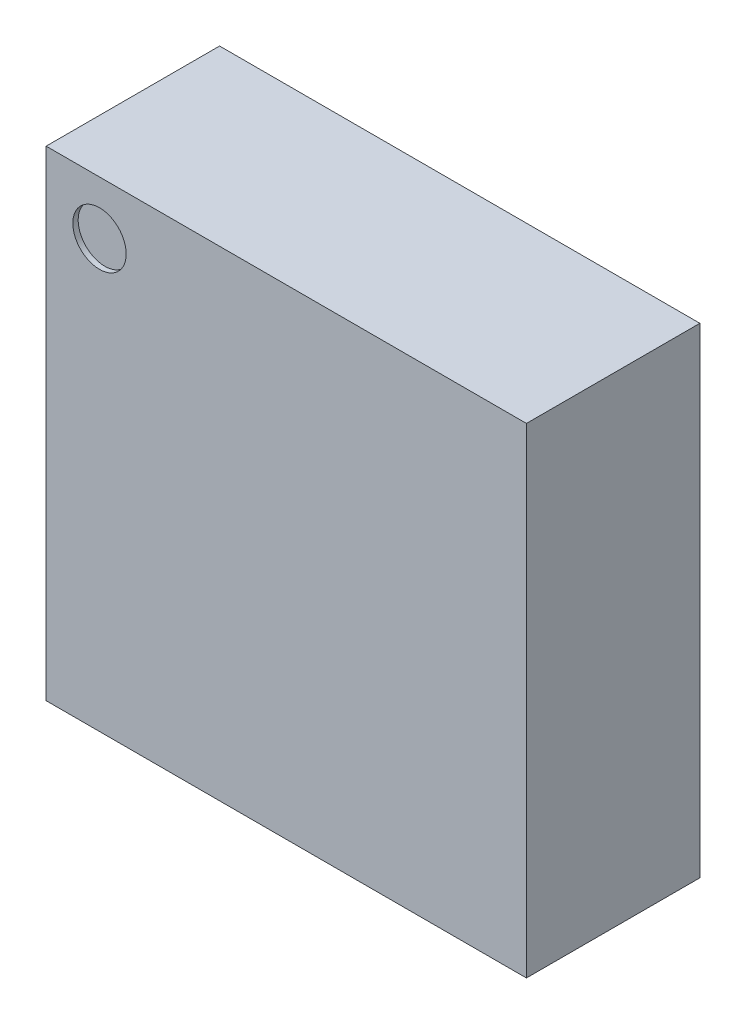
ISO-10303-21;
HEADER;
FILE_DESCRIPTION(('STEP AP214'),'2;1');
FILE_NAME('part.step','',(''),(''),'','','');
FILE_SCHEMA(('AUTOMOTIVE_DESIGN { 1 0 10303 214 1 1 1 1 }'));
ENDSEC;
DATA;
#1=APPLICATION_CONTEXT('core data for automotive mechanical design processes');
#2=APPLICATION_PROTOCOL_DEFINITION('international standard','automotive_design',2000,#1);
#3=PRODUCT_CONTEXT('',#1,'mechanical');
#4=PRODUCT('Part','Part','',(#3));
#5=PRODUCT_RELATED_PRODUCT_CATEGORY('part','',(#4));
#6=PRODUCT_DEFINITION_FORMATION('','',#4);
#7=PRODUCT_DEFINITION_CONTEXT('part definition',#1,'design');
#8=PRODUCT_DEFINITION('design','',#6,#7);
#9=PRODUCT_DEFINITION_SHAPE('','',#8);
#10=(LENGTH_UNIT() NAMED_UNIT(*) SI_UNIT(.MILLI.,.METRE.));
#11=(NAMED_UNIT(*) PLANE_ANGLE_UNIT() SI_UNIT($,.RADIAN.));
#12=(NAMED_UNIT(*) SI_UNIT($,.STERADIAN.) SOLID_ANGLE_UNIT());
#13=UNCERTAINTY_MEASURE_WITH_UNIT(LENGTH_MEASURE(1.E-05),#10,'distance_accuracy_value','');
#14=(GEOMETRIC_REPRESENTATION_CONTEXT(3) GLOBAL_UNCERTAINTY_ASSIGNED_CONTEXT((#13)) GLOBAL_UNIT_ASSIGNED_CONTEXT((#10,
#11,#12)) REPRESENTATION_CONTEXT('',''));
#15=CARTESIAN_POINT('',(0.,0.,0.));
#16=DIRECTION('',(0.,0.,1.));
#17=DIRECTION('',(1.,0.,0.));
#18=AXIS2_PLACEMENT_3D('',#15,#16,#17);
#19=CARTESIAN_POINT('',(0.,-0.4499999999995,0.44625));
#20=DIRECTION('',(0.,0.,1.));
#21=DIRECTION('',(1.,0.,0.));
#22=AXIS2_PLACEMENT_3D('',#19,#20,#21);
#23=PLANE('',#22);
#24=CARTESIAN_POINT('',(-0.35,0.3499999999995,0.44625));
#25=DIRECTION('',(0.,0.,1.));
#26=DIRECTION('',(-1.,0.,0.));
#27=AXIS2_PLACEMENT_3D('',#24,#25,#26);
#28=CIRCLE('',#27,0.05);
#29=CARTESIAN_POINT('',(-0.4,0.3499999999995,0.44625));
#30=VERTEX_POINT('',#29);
#31=CARTESIAN_POINT('',(-0.3,0.3499999999995,0.44625));
#32=VERTEX_POINT('',#31);
#33=EDGE_CURVE('E93',#30,#32,#28,.T.);
#34=ORIENTED_EDGE('',*,*,#33,.T.);
#35=CARTESIAN_POINT('',(-0.35,0.3499999999995,0.44625));
#36=DIRECTION('',(0.,0.,1.));
#37=DIRECTION('',(-1.,0.,0.));
#38=AXIS2_PLACEMENT_3D('',#35,#36,#37);
#39=CIRCLE('',#38,0.05);
#40=EDGE_CURVE('E20',#32,#30,#39,.T.);
#41=ORIENTED_EDGE('',*,*,#40,.T.);
#42=EDGE_LOOP('',(#34,#41));
#43=FACE_BOUND('',#42,.T.);
#44=ADVANCED_FACE('F16',(#43),#23,.T.);
#45=CARTESIAN_POINT('',(-0.35,0.3499999999995,0.45625));
#46=DIRECTION('',(0.,0.,1.));
#47=DIRECTION('',(-1.,0.,0.));
#48=AXIS2_PLACEMENT_3D('',#45,#46,#47);
#49=CYLINDRICAL_SURFACE('',#48,0.05);
#50=ORIENTED_EDGE('',*,*,#33,.F.);
#51=ORIENTED_EDGE('',*,*,#40,.F.);
#52=DIRECTION('',(0.,0.,1.));
#53=VECTOR('',#52,1.);
#54=CARTESIAN_POINT('',(-0.3,0.3499999999995,0.45625));
#55=LINE('',#54,#53);
#56=CARTESIAN_POINT('',(-0.3,0.3499999999995,0.45625));
#57=VERTEX_POINT('',#56);
#58=EDGE_CURVE('E11',#32,#57,#55,.T.);
#59=ORIENTED_EDGE('',*,*,#58,.T.);
#60=CARTESIAN_POINT('',(-0.35,0.3499999999995,0.45625));
#61=DIRECTION('',(0.,0.,1.));
#62=DIRECTION('',(-1.,0.,0.));
#63=AXIS2_PLACEMENT_3D('',#60,#61,#62);
#64=CIRCLE('',#63,0.05);
#65=CARTESIAN_POINT('',(-0.4,0.3499999999995,0.45625));
#66=VERTEX_POINT('',#65);
#67=EDGE_CURVE('E63',#57,#66,#64,.T.);
#68=ORIENTED_EDGE('',*,*,#67,.T.);
#69=CARTESIAN_POINT('',(-0.35,0.3499999999995,0.45625));
#70=DIRECTION('',(0.,0.,1.));
#71=DIRECTION('',(-1.,0.,0.));
#72=AXIS2_PLACEMENT_3D('',#69,#70,#71);
#73=CIRCLE('',#72,0.05);
#74=EDGE_CURVE('E113',#66,#57,#73,.T.);
#75=ORIENTED_EDGE('',*,*,#74,.T.);
#76=ORIENTED_EDGE('',*,*,#58,.F.);
#77=EDGE_LOOP('',(#50,#51,#59,#68,#75,#76));
#78=FACE_BOUND('',#77,.T.);
#79=ADVANCED_FACE('F129',(#78),#49,.F.);
#80=CARTESIAN_POINT('',(0.,0.4499999999995,0.));
#81=DIRECTION('',(0.,1.,0.));
#82=DIRECTION('',(1.,0.,0.));
#83=AXIS2_PLACEMENT_3D('',#80,#81,#82);
#84=PLANE('',#83);
#85=DIRECTION('',(0.,0.,-1.));
#86=VECTOR('',#85,1.);
#87=CARTESIAN_POINT('',(0.45,0.4499999999995,0.45625));
#88=LINE('',#87,#86);
#89=CARTESIAN_POINT('',(0.45,0.4499999999995,0.45625));
#90=VERTEX_POINT('',#89);
#91=CARTESIAN_POINT('',(0.45,0.4499999999995,0.13125));
#92=VERTEX_POINT('',#91);
#93=EDGE_CURVE('E89',#90,#92,#88,.T.);
#94=ORIENTED_EDGE('',*,*,#93,.T.);
#95=DIRECTION('',(-1.,0.,0.));
#96=VECTOR('',#95,1.);
#97=CARTESIAN_POINT('',(0.45,0.4499999999995,0.13125));
#98=LINE('',#97,#96);
#99=CARTESIAN_POINT('',(-0.45,0.4499999999995,0.13125));
#100=VERTEX_POINT('',#99);
#101=EDGE_CURVE('E85',#92,#100,#98,.T.);
#102=ORIENTED_EDGE('',*,*,#101,.T.);
#103=DIRECTION('',(0.,0.,1.));
#104=VECTOR('',#103,1.);
#105=CARTESIAN_POINT('',(-0.45,0.4499999999995,0.13125));
#106=LINE('',#105,#104);
#107=CARTESIAN_POINT('',(-0.45,0.4499999999995,0.45625));
#108=VERTEX_POINT('',#107);
#109=EDGE_CURVE('E76',#100,#108,#106,.T.);
#110=ORIENTED_EDGE('',*,*,#109,.T.);
#111=DIRECTION('',(1.,0.,0.));
#112=VECTOR('',#111,1.);
#113=CARTESIAN_POINT('',(-0.45,0.4499999999995,0.45625));
#114=LINE('',#113,#112);
#115=EDGE_CURVE('E116',#108,#90,#114,.T.);
#116=ORIENTED_EDGE('',*,*,#115,.T.);
#117=EDGE_LOOP('',(#94,#102,#110,#116));
#118=FACE_BOUND('',#117,.T.);
#119=ADVANCED_FACE('F87',(#118),#84,.T.);
#120=CARTESIAN_POINT('',(0.45,-0.4499999999995,0.13125));
#121=DIRECTION('',(0.,0.,-1.));
#122=DIRECTION('',(0.,-1.,0.));
#123=AXIS2_PLACEMENT_3D('',#120,#121,#122);
#124=PLANE('',#123);
#125=DIRECTION('',(-1.,0.,0.));
#126=VECTOR('',#125,1.);
#127=CARTESIAN_POINT('',(0.45,-0.4499999999995,0.13125));
#128=LINE('',#127,#126);
#129=CARTESIAN_POINT('',(0.45,-0.4499999999995,0.13125));
#130=VERTEX_POINT('',#129);
#131=CARTESIAN_POINT('',(-0.45,-0.4499999999995,0.13125));
#132=VERTEX_POINT('',#131);
#133=EDGE_CURVE('E99',#130,#132,#128,.T.);
#134=ORIENTED_EDGE('',*,*,#133,.T.);
#135=DIRECTION('',(0.,1.,0.));
#136=VECTOR('',#135,1.);
#137=CARTESIAN_POINT('',(-0.45,-0.4499999999995,0.13125));
#138=LINE('',#137,#136);
#139=EDGE_CURVE('E94',#132,#100,#138,.T.);
#140=ORIENTED_EDGE('',*,*,#139,.T.);
#141=ORIENTED_EDGE('',*,*,#101,.F.);
#142=DIRECTION('',(0.,1.,0.));
#143=VECTOR('',#142,1.);
#144=CARTESIAN_POINT('',(0.45,-0.4499999999995,0.13125));
#145=LINE('',#144,#143);
#146=EDGE_CURVE('E166',#130,#92,#145,.T.);
#147=ORIENTED_EDGE('',*,*,#146,.F.);
#148=EDGE_LOOP('',(#134,#140,#141,#147));
#149=FACE_BOUND('',#148,.T.);
#150=ADVANCED_FACE('F18',(#149),#124,.T.);
#151=CARTESIAN_POINT('',(-0.45,-0.4499999999995,0.13125));
#152=DIRECTION('',(-1.,0.,0.));
#153=DIRECTION('',(0.,0.,1.));
#154=AXIS2_PLACEMENT_3D('',#151,#152,#153);
#155=PLANE('',#154);
#156=DIRECTION('',(0.,0.,1.));
#157=VECTOR('',#156,1.);
#158=CARTESIAN_POINT('',(-0.45,-0.4499999999995,0.13125));
#159=LINE('',#158,#157);
#160=CARTESIAN_POINT('',(-0.45,-0.4499999999995,0.45625));
#161=VERTEX_POINT('',#160);
#162=EDGE_CURVE('E161',#132,#161,#159,.T.);
#163=ORIENTED_EDGE('',*,*,#162,.T.);
#164=DIRECTION('',(0.,1.,0.));
#165=VECTOR('',#164,1.);
#166=CARTESIAN_POINT('',(-0.45,-0.4499999999995,0.45625));
#167=LINE('',#166,#165);
#168=EDGE_CURVE('E106',#161,#108,#167,.T.);
#169=ORIENTED_EDGE('',*,*,#168,.T.);
#170=ORIENTED_EDGE('',*,*,#109,.F.);
#171=ORIENTED_EDGE('',*,*,#139,.F.);
#172=EDGE_LOOP('',(#163,#169,#170,#171));
#173=FACE_BOUND('',#172,.T.);
#174=ADVANCED_FACE('F105',(#173),#155,.T.);
#175=CARTESIAN_POINT('',(-0.45,-0.4499999999995,0.45625));
#176=DIRECTION('',(0.,0.,1.));
#177=DIRECTION('',(1.,0.,0.));
#178=AXIS2_PLACEMENT_3D('',#175,#176,#177);
#179=PLANE('',#178);
#180=ORIENTED_EDGE('',*,*,#74,.F.);
#181=ORIENTED_EDGE('',*,*,#67,.F.);
#182=EDGE_LOOP('',(#180,#181));
#183=FACE_BOUND('',#182,.T.);
#184=DIRECTION('',(1.,0.,0.));
#185=VECTOR('',#184,1.);
#186=CARTESIAN_POINT('',(-0.45,-0.4499999999995,0.45625));
#187=LINE('',#186,#185);
#188=CARTESIAN_POINT('',(0.45,-0.4499999999995,0.45625));
#189=VERTEX_POINT('',#188);
#190=EDGE_CURVE('E154',#161,#189,#187,.T.);
#191=ORIENTED_EDGE('',*,*,#190,.T.);
#192=DIRECTION('',(0.,1.,0.));
#193=VECTOR('',#192,1.);
#194=CARTESIAN_POINT('',(0.45,-0.4499999999995,0.45625));
#195=LINE('',#194,#193);
#196=EDGE_CURVE('E119',#189,#90,#195,.T.);
#197=ORIENTED_EDGE('',*,*,#196,.T.);
#198=ORIENTED_EDGE('',*,*,#115,.F.);
#199=ORIENTED_EDGE('',*,*,#168,.F.);
#200=EDGE_LOOP('',(#191,#197,#198,#199));
#201=FACE_BOUND('',#200,.T.);
#202=ADVANCED_FACE('F147',(#183,#201),#179,.T.);
#203=CARTESIAN_POINT('',(0.45,-0.4499999999995,0.45625));
#204=DIRECTION('',(1.,0.,0.));
#205=DIRECTION('',(0.,1.,0.));
#206=AXIS2_PLACEMENT_3D('',#203,#204,#205);
#207=PLANE('',#206);
#208=DIRECTION('',(0.,0.,-1.));
#209=VECTOR('',#208,1.);
#210=CARTESIAN_POINT('',(0.45,-0.4499999999995,0.45625));
#211=LINE('',#210,#209);
#212=EDGE_CURVE('E152',#189,#130,#211,.T.);
#213=ORIENTED_EDGE('',*,*,#212,.T.);
#214=ORIENTED_EDGE('',*,*,#146,.T.);
#215=ORIENTED_EDGE('',*,*,#93,.F.);
#216=ORIENTED_EDGE('',*,*,#196,.F.);
#217=EDGE_LOOP('',(#213,#214,#215,#216));
#218=FACE_BOUND('',#217,.T.);
#219=ADVANCED_FACE('F142',(#218),#207,.T.);
#220=CARTESIAN_POINT('',(0.,-0.4499999999995,0.));
#221=DIRECTION('',(0.,1.,0.));
#222=DIRECTION('',(1.,0.,0.));
#223=AXIS2_PLACEMENT_3D('',#220,#221,#222);
#224=PLANE('',#223);
#225=ORIENTED_EDGE('',*,*,#212,.F.);
#226=ORIENTED_EDGE('',*,*,#190,.F.);
#227=ORIENTED_EDGE('',*,*,#162,.F.);
#228=ORIENTED_EDGE('',*,*,#133,.F.);
#229=EDGE_LOOP('',(#225,#226,#227,#228));
#230=FACE_BOUND('',#229,.T.);
#231=ADVANCED_FACE('F140',(#230),#224,.F.);
#232=CLOSED_SHELL('',(#44,#79,#119,#150,#174,#202,#219,#231));
#233=MANIFOLD_SOLID_BREP('B1',#232);
#234=ADVANCED_BREP_SHAPE_REPRESENTATION('',(#18,#233),#14);
#235=SHAPE_DEFINITION_REPRESENTATION(#9,#234);
ENDSEC;
END-ISO-10303-21;
